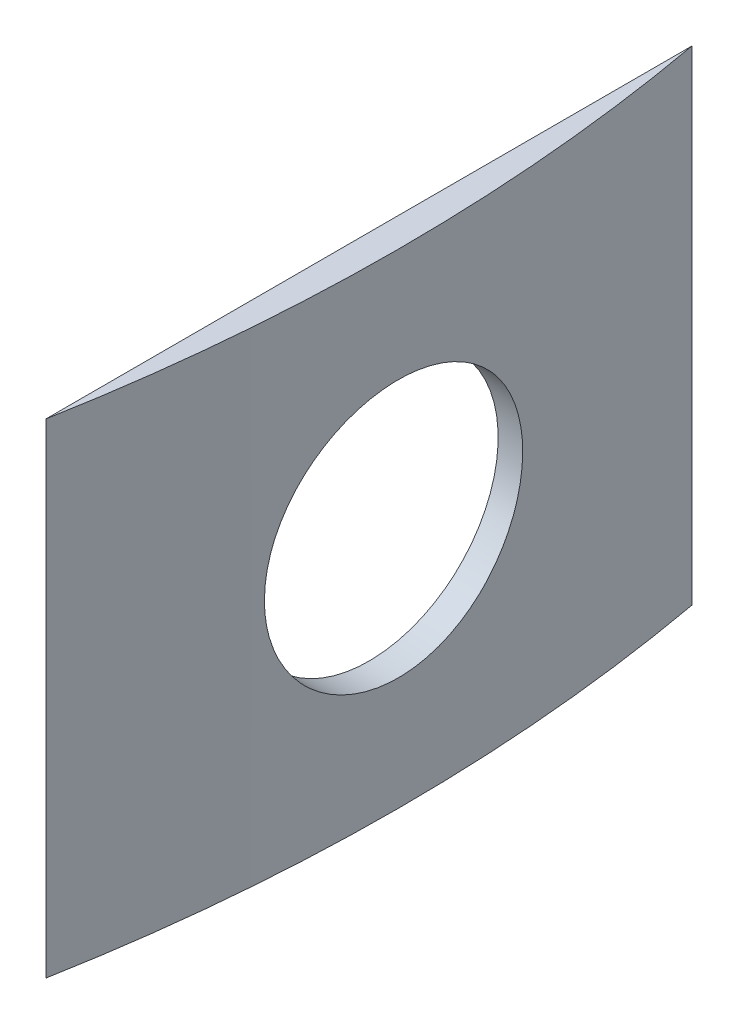
ISO-10303-21;
HEADER;
FILE_DESCRIPTION(('STEP AP214'),'2;1');
FILE_NAME('part.step','',(''),(''),'','','');
FILE_SCHEMA(('AUTOMOTIVE_DESIGN { 1 0 10303 214 1 1 1 1 }'));
ENDSEC;
DATA;
#1=APPLICATION_CONTEXT('core data for automotive mechanical design processes');
#2=APPLICATION_PROTOCOL_DEFINITION('international standard','automotive_design',2000,#1);
#3=PRODUCT_CONTEXT('',#1,'mechanical');
#4=PRODUCT('Part','Part','',(#3));
#5=PRODUCT_RELATED_PRODUCT_CATEGORY('part','',(#4));
#6=PRODUCT_DEFINITION_FORMATION('','',#4);
#7=PRODUCT_DEFINITION_CONTEXT('part definition',#1,'design');
#8=PRODUCT_DEFINITION('design','',#6,#7);
#9=PRODUCT_DEFINITION_SHAPE('','',#8);
#10=(LENGTH_UNIT() NAMED_UNIT(*) SI_UNIT(.MILLI.,.METRE.));
#11=(NAMED_UNIT(*) PLANE_ANGLE_UNIT() SI_UNIT($,.RADIAN.));
#12=(NAMED_UNIT(*) SI_UNIT($,.STERADIAN.) SOLID_ANGLE_UNIT());
#13=UNCERTAINTY_MEASURE_WITH_UNIT(LENGTH_MEASURE(1.E-05),#10,'distance_accuracy_value','');
#14=(GEOMETRIC_REPRESENTATION_CONTEXT(3) GLOBAL_UNCERTAINTY_ASSIGNED_CONTEXT((#13)) GLOBAL_UNIT_ASSIGNED_CONTEXT((#10,
#11,#12)) REPRESENTATION_CONTEXT('',''));
#15=CARTESIAN_POINT('',(0.,0.,0.));
#16=DIRECTION('',(0.,0.,1.));
#17=DIRECTION('',(1.,0.,0.));
#18=AXIS2_PLACEMENT_3D('',#15,#16,#17);
#19=CARTESIAN_POINT('',(54.8458065853717,15.,-3.99597694618616E-13));
#20=DIRECTION('',(-1.,0.,0.));
#21=DIRECTION('',(0.,0.,1.));
#22=AXIS2_PLACEMENT_3D('',#19,#20,#21);
#23=PLANE('',#22);
#24=CARTESIAN_POINT('',(54.8458065853717,7.5,0.));
#25=DIRECTION('',(-1.,0.,0.));
#26=DIRECTION('',(0.,0.,1.));
#27=AXIS2_PLACEMENT_3D('',#24,#25,#26);
#28=CIRCLE('',#27,4.);
#29=CARTESIAN_POINT('',(54.8458065853717,7.5,4.));
#30=VERTEX_POINT('',#29);
#31=EDGE_CURVE('E76',#30,#30,#28,.T.);
#32=ORIENTED_EDGE('',*,*,#31,.F.);
#33=EDGE_LOOP('',(#32));
#34=FACE_BOUND('',#33,.T.);
#35=DIRECTION('',(0.,0.,-1.));
#36=VECTOR('',#35,1.);
#37=CARTESIAN_POINT('',(54.8458065853717,0.,-3.99597694618616E-13));
#38=LINE('',#37,#36);
#39=CARTESIAN_POINT('',(54.8458065853717,0.,9.9999999999996));
#40=VERTEX_POINT('',#39);
#41=CARTESIAN_POINT('',(54.8458065853716,0.,-10.0000000000004));
#42=VERTEX_POINT('',#41);
#43=EDGE_CURVE('E68',#40,#42,#38,.T.);
#44=ORIENTED_EDGE('',*,*,#43,.F.);
#45=DIRECTION('',(0.,-1.,0.));
#46=VECTOR('',#45,1.);
#47=CARTESIAN_POINT('',(54.8458065853717,15.,9.9999999999996));
#48=LINE('',#47,#46);
#49=CARTESIAN_POINT('',(54.8458065853717,15.,9.9999999999996));
#50=VERTEX_POINT('',#49);
#51=EDGE_CURVE('E11',#50,#40,#48,.T.);
#52=ORIENTED_EDGE('',*,*,#51,.F.);
#53=DIRECTION('',(0.,0.,-1.));
#54=VECTOR('',#53,1.);
#55=CARTESIAN_POINT('',(54.8458065853717,15.,-3.99597694618616E-13));
#56=LINE('',#55,#54);
#57=CARTESIAN_POINT('',(54.8458065853716,15.,-10.0000000000004));
#58=VERTEX_POINT('',#57);
#59=EDGE_CURVE('E69',#50,#58,#56,.T.);
#60=ORIENTED_EDGE('',*,*,#59,.T.);
#61=DIRECTION('',(0.,-1.,0.));
#62=VECTOR('',#61,1.);
#63=CARTESIAN_POINT('',(54.8458065853716,15.,-10.0000000000004));
#64=LINE('',#63,#62);
#65=EDGE_CURVE('E48',#58,#42,#64,.T.);
#66=ORIENTED_EDGE('',*,*,#65,.T.);
#67=EDGE_LOOP('',(#44,#52,#60,#66));
#68=FACE_BOUND('',#67,.T.);
#69=ADVANCED_FACE('F35',(#34,#68),#23,.T.);
#70=CARTESIAN_POINT('',(0.,15.,0.));
#71=DIRECTION('',(0.,-1.,0.));
#72=DIRECTION('',(0.,0.,-1.));
#73=AXIS2_PLACEMENT_3D('',#70,#71,#72);
#74=CYLINDRICAL_SURFACE('',#73,55.75);
#75=CARTESIAN_POINT('',(55.6063170871799,7.5,4.));
#76=CARTESIAN_POINT('',(55.606319001743,7.72437128723097,3.99999015513627));
#77=CARTESIAN_POINT('',(55.6076897024949,7.94889790046795,3.98105810253127));
#78=CARTESIAN_POINT('',(55.6130247637542,8.39174623612431,3.90580905043965));
#79=CARTESIAN_POINT('',(55.6169921103717,8.6100605124533,3.84944900814121));
#80=CARTESIAN_POINT('',(55.6270687919064,9.03400568070661,3.70097574839111));
#81=CARTESIAN_POINT('',(55.6331769617957,9.2396433997372,3.60888197418745));
#82=CARTESIAN_POINT('',(55.6468455798569,9.63248997052153,3.39158823582903));
#83=CARTESIAN_POINT('',(55.6544057044168,9.81970291475664,3.2663956464076));
#84=CARTESIAN_POINT('',(55.6701428976254,10.1708002391174,2.98619408978148));
#85=CARTESIAN_POINT('',(55.6783210015216,10.3346440834643,2.83113438432756));
#86=CARTESIAN_POINT('',(55.6943631208025,10.634004722586,2.49570627691031));
#87=CARTESIAN_POINT('',(55.7022271228236,10.7695203131613,2.31533679960386));
#88=CARTESIAN_POINT('',(55.7167643338742,11.0085072287559,1.93417407756709));
#89=CARTESIAN_POINT('',(55.7234362659476,11.1119442771613,1.73335928872818));
#90=CARTESIAN_POINT('',(55.7348265497783,11.2836185741863,1.31715707933306));
#91=CARTESIAN_POINT('',(55.7395449278668,11.3518562972476,1.10176985523879));
#92=CARTESIAN_POINT('',(55.7464892719453,11.4510804268867,0.662933698447048));
#93=CARTESIAN_POINT('',(55.7487195540359,11.48213134832,0.439499422415769));
#94=CARTESIAN_POINT('',(55.7504509889283,11.5062997722799,-0.00942009081882807));
#95=CARTESIAN_POINT('',(55.7499521806723,11.4994178160831,-0.234905298710888));
#96=CARTESIAN_POINT('',(55.7462852217594,11.4479688586242,-0.681088811090278));
#97=CARTESIAN_POINT('',(55.7431219859834,11.4034712437619,-0.901795162450428));
#98=CARTESIAN_POINT('',(55.7344878157472,11.2781618573725,-1.33259802129567));
#99=CARTESIAN_POINT('',(55.7290168642055,11.1973498170469,-1.54269445023361));
#100=CARTESIAN_POINT('',(55.7163745796179,11.0016274706477,-1.94653555865454));
#101=CARTESIAN_POINT('',(55.709201687272,10.8866858710117,-2.14026502086499));
#102=CARTESIAN_POINT('',(55.6939622980902,10.6259899173408,-2.5057067909152));
#103=CARTESIAN_POINT('',(55.6858957878973,10.4802351027131,-2.67741876957816));
#104=CARTESIAN_POINT('',(55.6697550110893,10.1616586147945,-2.99435657256637));
#105=CARTESIAN_POINT('',(55.6616807679559,9.98877668933064,-3.13952184124673));
#106=CARTESIAN_POINT('',(55.6464529514789,9.6210640947624,-3.39877823945567));
#107=CARTESIAN_POINT('',(55.6392993786405,9.42623341361222,-3.51286935193018));
#108=CARTESIAN_POINT('',(55.6267210785838,9.02011369306017,-3.70673532010652));
#109=CARTESIAN_POINT('',(55.6212964920537,8.80882331606739,-3.7865073834408));
#110=CARTESIAN_POINT('',(55.6127926267104,8.37580068014735,-3.90942777709809));
#111=CARTESIAN_POINT('',(55.6097133114685,8.15406858346623,-3.95257667628323));
#112=CARTESIAN_POINT('',(55.606254130011,7.70698556430108,-4.00094996312363));
#113=CARTESIAN_POINT('',(55.6058682643976,7.48164380576896,-4.00625863676921));
#114=CARTESIAN_POINT('',(55.607823813203,7.03327326733672,-3.97902123021374));
#115=CARTESIAN_POINT('',(55.6101652088465,6.81024447152404,-3.94647541061602));
#116=CARTESIAN_POINT('',(55.6173059660489,6.37307064871178,-3.84452299147208));
#117=CARTESIAN_POINT('',(55.622102724864,6.15891647371853,-3.77515542098856));
#118=CARTESIAN_POINT('',(55.6336115058677,5.74528816375747,-3.60156817918868));
#119=CARTESIAN_POINT('',(55.6403235509224,5.54581420408812,-3.49734809177601));
#120=CARTESIAN_POINT('',(55.6549211240385,5.16682208786178,-3.256799714698));
#121=CARTESIAN_POINT('',(55.6628087025141,4.9873397769706,-3.12041507524182));
#122=CARTESIAN_POINT('',(55.6788614760448,4.65378738315474,-2.81949080667957));
#123=CARTESIAN_POINT('',(55.6870266746555,4.49971762583462,-2.6549508168812));
#124=CARTESIAN_POINT('',(55.7027323194713,4.22107788242361,-2.30202317095288));
#125=CARTESIAN_POINT('',(55.7102715921648,4.09656252869042,-2.11359232270883));
#126=CARTESIAN_POINT('',(55.7238590210765,3.88094037191298,-1.71844818973145));
#127=CARTESIAN_POINT('',(55.7299071888468,3.78983331004124,-1.51173504665381));
#128=CARTESIAN_POINT('',(55.73982542944,3.64370847446656,-1.08609291535752));
#129=CARTESIAN_POINT('',(55.7436975689297,3.58865644951096,-0.867175735830747));
#130=CARTESIAN_POINT('',(55.7488357731401,3.51609238097118,-0.423176530130186));
#131=CARTESIAN_POINT('',(55.7501018731717,3.49857982874225,-0.198094587528306));
#132=CARTESIAN_POINT('',(55.7498854312251,3.50159711754229,0.251305111308617));
#133=CARTESIAN_POINT('',(55.7484090558558,3.52204160998258,0.475623448517641));
#134=CARTESIAN_POINT('',(55.7428858366691,3.60021526081151,0.917632877594238));
#135=CARTESIAN_POINT('',(55.7388389886987,3.65794447943844,1.13532395875403));
#136=CARTESIAN_POINT('',(55.7286293415329,3.80902850925539,1.5579090513845));
#137=CARTESIAN_POINT('',(55.7224665945953,3.90238244060219,1.76280337875827));
#138=CARTESIAN_POINT('',(55.708716070855,4.12205520229879,2.1540231175557));
#139=CARTESIAN_POINT('',(55.7011283250835,4.2483733148349,2.34034893319712));
#140=CARTESIAN_POINT('',(55.6853602553165,4.53070728970209,2.68957771749001));
#141=CARTESIAN_POINT('',(55.6771787065977,4.68678567676006,2.85243008166542));
#142=CARTESIAN_POINT('',(55.6611553346221,5.02410976414352,3.14968395942152));
#143=CARTESIAN_POINT('',(55.6533135946246,5.2053615871837,3.2840785313251));
#144=CARTESIAN_POINT('',(55.6388447985131,5.58815296686331,3.52073449833959));
#145=CARTESIAN_POINT('',(55.6322195767343,5.78972246221902,3.62294753147338));
#146=CARTESIAN_POINT('',(55.6209568929543,6.20706683365629,3.79195136616636));
#147=CARTESIAN_POINT('',(55.6163171215028,6.42282486678929,3.85878334410049));
#148=CARTESIAN_POINT('',(55.6107574022075,6.78323674099929,3.93789980449026));
#149=CARTESIAN_POINT('',(55.6090998116533,6.92556543212143,3.96115692204382));
#150=CARTESIAN_POINT('',(55.6068790404682,7.21190806832783,3.99221016602481));
#151=CARTESIAN_POINT('',(55.6063158577606,7.35592201021375,4.00000632179007));
#152=CARTESIAN_POINT('',(55.6063170871799,7.5,4.));
#153=B_SPLINE_CURVE_WITH_KNOTS('',3,(#75,#76,#77,#78,#79,#80,#81,#82,#83,#84,#85,#86,#87,#88,
#89,#90,#91,#92,#93,#94,#95,#96,#97,#98,#99,#100,#101,#102,#103,#104,#105,#106,#107,#108,#109,
#110,#111,#112,#113,#114,#115,#116,#117,#118,#119,#120,#121,#122,#123,#124,#125,#126,#127,#128,
#129,#130,#131,#132,#133,#134,#135,#136,#137,#138,#139,#140,#141,#142,#143,#144,#145,#146,#147,
#148,#149,#150,#151,#152),.UNSPECIFIED.,.T.,.F.,(4,2,2,2,2,2,2,2,2,2,2,2,2,2,2,2,2,2,2,2,2,2,2,
2,2,2,2,2,2,2,2,2,2,2,2,2,2,2,4),(0.,0.672587854897649,1.34595053961065,2.01894735043122,
2.69179433729717,3.36579460148279,4.03982351077546,4.7145701725935,5.38930773945708,
6.06287301002194,6.73642866928738,7.40874458216213,8.08106547158308,8.75400472902537,
9.42695404620786,10.101419783028,10.7758858900068,11.4504068645095,12.1249173615873,
12.797924971175,13.4709279475747,14.1432189975012,14.8155180740452,15.4890038322311,
16.162498218948,16.8372280532176,17.5119526599729,18.1860353643484,18.8601089351168,
19.5326686482265,20.2052294479463,20.8777736381353,21.5503031845158,22.224261565911,
22.898384156311,23.5735150262339,24.2478584437786,24.6797554621819,25.1116516610415),.UNSPECIFIED.);
#154=CARTESIAN_POINT('',(55.6063170871799,7.5,4.));
#155=VERTEX_POINT('',#154);
#156=EDGE_CURVE('E38',#155,#155,#153,.T.);
#157=ORIENTED_EDGE('',*,*,#156,.T.);
#158=EDGE_LOOP('',(#157));
#159=FACE_BOUND('',#158,.T.);
#160=CARTESIAN_POINT('',(0.,0.,0.));
#161=DIRECTION('',(0.,1.,0.));
#162=DIRECTION('',(0.,0.,1.));
#163=AXIS2_PLACEMENT_3D('',#160,#161,#162);
#164=CIRCLE('',#163,55.75);
#165=EDGE_CURVE('E71',#40,#42,#164,.T.);
#166=ORIENTED_EDGE('',*,*,#165,.T.);
#167=ORIENTED_EDGE('',*,*,#65,.F.);
#168=CARTESIAN_POINT('',(0.,15.,0.));
#169=DIRECTION('',(0.,1.,0.));
#170=DIRECTION('',(0.,0.,1.));
#171=AXIS2_PLACEMENT_3D('',#168,#169,#170);
#172=CIRCLE('',#171,55.75);
#173=EDGE_CURVE('E55',#50,#58,#172,.T.);
#174=ORIENTED_EDGE('',*,*,#173,.F.);
#175=ORIENTED_EDGE('',*,*,#51,.T.);
#176=EDGE_LOOP('',(#166,#167,#174,#175));
#177=FACE_BOUND('',#176,.T.);
#178=ADVANCED_FACE('F72',(#159,#177),#74,.T.);
#179=CARTESIAN_POINT('',(0.,15.,0.));
#180=DIRECTION('',(0.,1.,0.));
#181=DIRECTION('',(0.,0.,1.));
#182=AXIS2_PLACEMENT_3D('',#179,#180,#181);
#183=PLANE('',#182);
#184=ORIENTED_EDGE('',*,*,#59,.F.);
#185=ORIENTED_EDGE('',*,*,#173,.T.);
#186=EDGE_LOOP('',(#184,#185));
#187=FACE_BOUND('',#186,.T.);
#188=ADVANCED_FACE('F93',(#187),#183,.T.);
#189=CARTESIAN_POINT('',(0.,0.,0.));
#190=DIRECTION('',(0.,1.,0.));
#191=DIRECTION('',(0.,0.,1.));
#192=AXIS2_PLACEMENT_3D('',#189,#190,#191);
#193=PLANE('',#192);
#194=ORIENTED_EDGE('',*,*,#43,.T.);
#195=ORIENTED_EDGE('',*,*,#165,.F.);
#196=EDGE_LOOP('',(#194,#195));
#197=FACE_BOUND('',#196,.T.);
#198=ADVANCED_FACE('F75',(#197),#193,.F.);
#199=CARTESIAN_POINT('',(83.4645599050454,7.5,0.));
#200=DIRECTION('',(-1.,0.,0.));
#201=DIRECTION('',(0.,0.,1.));
#202=AXIS2_PLACEMENT_3D('',#199,#200,#201);
#203=CYLINDRICAL_SURFACE('',#202,4.);
#204=ORIENTED_EDGE('',*,*,#31,.T.);
#205=EDGE_LOOP('',(#204));
#206=FACE_BOUND('',#205,.T.);
#207=ORIENTED_EDGE('',*,*,#156,.F.);
#208=EDGE_LOOP('',(#207));
#209=FACE_BOUND('',#208,.T.);
#210=ADVANCED_FACE('F88',(#206,#209),#203,.F.);
#211=CLOSED_SHELL('',(#69,#178,#188,#198,#210));
#212=MANIFOLD_SOLID_BREP('B2',#211);
#213=ADVANCED_BREP_SHAPE_REPRESENTATION('',(#18,#212),#14);
#214=SHAPE_DEFINITION_REPRESENTATION(#9,#213);
ENDSEC;
END-ISO-10303-21;
